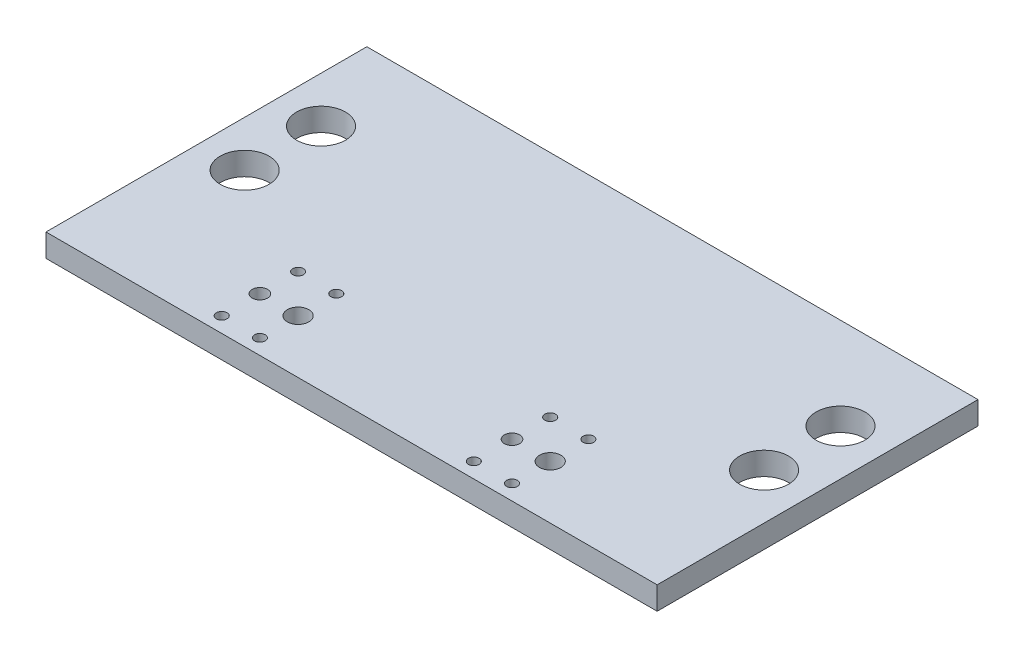
ISO-10303-21;
HEADER;
FILE_DESCRIPTION(('STEP AP214'),'2;1');
FILE_NAME('part.step','',(''),(''),'','','');
FILE_SCHEMA(('AUTOMOTIVE_DESIGN { 1 0 10303 214 1 1 1 1 }'));
ENDSEC;
DATA;
#1=APPLICATION_CONTEXT('core data for automotive mechanical design processes');
#2=APPLICATION_PROTOCOL_DEFINITION('international standard','automotive_design',2000,#1);
#3=PRODUCT_CONTEXT('',#1,'mechanical');
#4=PRODUCT('Part','Part','',(#3));
#5=PRODUCT_RELATED_PRODUCT_CATEGORY('part','',(#4));
#6=PRODUCT_DEFINITION_FORMATION('','',#4);
#7=PRODUCT_DEFINITION_CONTEXT('part definition',#1,'design');
#8=PRODUCT_DEFINITION('design','',#6,#7);
#9=PRODUCT_DEFINITION_SHAPE('','',#8);
#10=(LENGTH_UNIT() NAMED_UNIT(*) SI_UNIT(.MILLI.,.METRE.));
#11=(NAMED_UNIT(*) PLANE_ANGLE_UNIT() SI_UNIT($,.RADIAN.));
#12=(NAMED_UNIT(*) SI_UNIT($,.STERADIAN.) SOLID_ANGLE_UNIT());
#13=UNCERTAINTY_MEASURE_WITH_UNIT(LENGTH_MEASURE(1.E-05),#10,'distance_accuracy_value','');
#14=(GEOMETRIC_REPRESENTATION_CONTEXT(3) GLOBAL_UNCERTAINTY_ASSIGNED_CONTEXT((#13)) GLOBAL_UNIT_ASSIGNED_CONTEXT((#10,
#11,#12)) REPRESENTATION_CONTEXT('',''));
#15=CARTESIAN_POINT('',(0.,0.,0.));
#16=DIRECTION('',(0.,0.,1.));
#17=DIRECTION('',(1.,0.,0.));
#18=AXIS2_PLACEMENT_3D('',#15,#16,#17);
#19=CARTESIAN_POINT('',(0.,1.5,0.));
#20=DIRECTION('',(1.,0.,0.));
#21=DIRECTION('',(0.,0.,-1.));
#22=AXIS2_PLACEMENT_3D('',#19,#20,#21);
#23=PLANE('',#22);
#24=DIRECTION('',(0.,0.,1.));
#25=VECTOR('',#24,1.);
#26=CARTESIAN_POINT('',(0.,0.,0.));
#27=LINE('',#26,#25);
#28=CARTESIAN_POINT('',(0.,0.,-21.));
#29=VERTEX_POINT('',#28);
#30=CARTESIAN_POINT('',(0.,0.,0.));
#31=VERTEX_POINT('',#30);
#32=EDGE_CURVE('E94',#29,#31,#27,.T.);
#33=ORIENTED_EDGE('',*,*,#32,.T.);
#34=DIRECTION('',(0.,-1.,0.));
#35=VECTOR('',#34,1.);
#36=CARTESIAN_POINT('',(0.,1.5,0.));
#37=LINE('',#36,#35);
#38=CARTESIAN_POINT('',(0.,1.5,0.));
#39=VERTEX_POINT('',#38);
#40=EDGE_CURVE('E11',#39,#31,#37,.T.);
#41=ORIENTED_EDGE('',*,*,#40,.F.);
#42=DIRECTION('',(0.,0.,1.));
#43=VECTOR('',#42,1.);
#44=CARTESIAN_POINT('',(0.,1.5,0.));
#45=LINE('',#44,#43);
#46=CARTESIAN_POINT('',(0.,1.5,-21.));
#47=VERTEX_POINT('',#46);
#48=EDGE_CURVE('E82',#47,#39,#45,.T.);
#49=ORIENTED_EDGE('',*,*,#48,.F.);
#50=DIRECTION('',(0.,-1.,0.));
#51=VECTOR('',#50,1.);
#52=CARTESIAN_POINT('',(0.,1.5,-21.));
#53=LINE('',#52,#51);
#54=EDGE_CURVE('E90',#47,#29,#53,.T.);
#55=ORIENTED_EDGE('',*,*,#54,.T.);
#56=EDGE_LOOP('',(#33,#41,#49,#55));
#57=FACE_BOUND('',#56,.T.);
#58=ADVANCED_FACE('F31',(#57),#23,.F.);
#59=CARTESIAN_POINT('',(0.,1.5,0.));
#60=DIRECTION('',(0.,0.,-1.));
#61=DIRECTION('',(-1.,0.,0.));
#62=AXIS2_PLACEMENT_3D('',#59,#60,#61);
#63=PLANE('',#62);
#64=DIRECTION('',(1.,0.,0.));
#65=VECTOR('',#64,1.);
#66=CARTESIAN_POINT('',(0.,0.,0.));
#67=LINE('',#66,#65);
#68=CARTESIAN_POINT('',(40.,0.,0.));
#69=VERTEX_POINT('',#68);
#70=EDGE_CURVE('E86',#31,#69,#67,.T.);
#71=ORIENTED_EDGE('',*,*,#70,.T.);
#72=DIRECTION('',(0.,-1.,0.));
#73=VECTOR('',#72,1.);
#74=CARTESIAN_POINT('',(40.,1.5,0.));
#75=LINE('',#74,#73);
#76=CARTESIAN_POINT('',(40.,1.5,0.));
#77=VERTEX_POINT('',#76);
#78=EDGE_CURVE('E39',#77,#69,#75,.T.);
#79=ORIENTED_EDGE('',*,*,#78,.F.);
#80=DIRECTION('',(1.,0.,0.));
#81=VECTOR('',#80,1.);
#82=CARTESIAN_POINT('',(0.,1.5,0.));
#83=LINE('',#82,#81);
#84=EDGE_CURVE('E77',#39,#77,#83,.T.);
#85=ORIENTED_EDGE('',*,*,#84,.F.);
#86=ORIENTED_EDGE('',*,*,#40,.T.);
#87=EDGE_LOOP('',(#71,#79,#85,#86));
#88=FACE_BOUND('',#87,.T.);
#89=ADVANCED_FACE('F85',(#88),#63,.F.);
#90=CARTESIAN_POINT('',(40.,1.5,0.));
#91=DIRECTION('',(-1.,0.,0.));
#92=DIRECTION('',(0.,0.,1.));
#93=AXIS2_PLACEMENT_3D('',#90,#91,#92);
#94=PLANE('',#93);
#95=DIRECTION('',(0.,0.,-1.));
#96=VECTOR('',#95,1.);
#97=CARTESIAN_POINT('',(40.,0.,0.));
#98=LINE('',#97,#96);
#99=CARTESIAN_POINT('',(40.,0.,-21.));
#100=VERTEX_POINT('',#99);
#101=EDGE_CURVE('E64',#69,#100,#98,.T.);
#102=ORIENTED_EDGE('',*,*,#101,.T.);
#103=DIRECTION('',(0.,-1.,0.));
#104=VECTOR('',#103,1.);
#105=CARTESIAN_POINT('',(40.,1.5,-21.));
#106=LINE('',#105,#104);
#107=CARTESIAN_POINT('',(40.,1.5,-21.));
#108=VERTEX_POINT('',#107);
#109=EDGE_CURVE('E87',#108,#100,#106,.T.);
#110=ORIENTED_EDGE('',*,*,#109,.F.);
#111=DIRECTION('',(0.,0.,-1.));
#112=VECTOR('',#111,1.);
#113=CARTESIAN_POINT('',(40.,1.5,0.));
#114=LINE('',#113,#112);
#115=EDGE_CURVE('E80',#77,#108,#114,.T.);
#116=ORIENTED_EDGE('',*,*,#115,.F.);
#117=ORIENTED_EDGE('',*,*,#78,.T.);
#118=EDGE_LOOP('',(#102,#110,#116,#117));
#119=FACE_BOUND('',#118,.T.);
#120=ADVANCED_FACE('F88',(#119),#94,.F.);
#121=CARTESIAN_POINT('',(0.,1.5,-21.));
#122=DIRECTION('',(0.,0.,1.));
#123=DIRECTION('',(1.,0.,0.));
#124=AXIS2_PLACEMENT_3D('',#121,#122,#123);
#125=PLANE('',#124);
#126=DIRECTION('',(-1.,0.,0.));
#127=VECTOR('',#126,1.);
#128=CARTESIAN_POINT('',(0.,0.,-21.));
#129=LINE('',#128,#127);
#130=EDGE_CURVE('E70',#100,#29,#129,.T.);
#131=ORIENTED_EDGE('',*,*,#130,.T.);
#132=ORIENTED_EDGE('',*,*,#54,.F.);
#133=DIRECTION('',(-1.,0.,0.));
#134=VECTOR('',#133,1.);
#135=CARTESIAN_POINT('',(0.,1.5,-21.));
#136=LINE('',#135,#134);
#137=EDGE_CURVE('E47',#108,#47,#136,.T.);
#138=ORIENTED_EDGE('',*,*,#137,.F.);
#139=ORIENTED_EDGE('',*,*,#109,.T.);
#140=EDGE_LOOP('',(#131,#132,#138,#139));
#141=FACE_BOUND('',#140,.T.);
#142=ADVANCED_FACE('F102',(#141),#125,.F.);
#143=CARTESIAN_POINT('',(0.,1.5,-21.));
#144=DIRECTION('',(0.,-1.,0.));
#145=DIRECTION('',(0.,0.,-1.));
#146=AXIS2_PLACEMENT_3D('',#143,#144,#145);
#147=PLANE('',#146);
#148=CARTESIAN_POINT('',(37.,1.5,-15.));
#149=DIRECTION('',(0.,1.,0.));
#150=DIRECTION('',(0.,0.,1.));
#151=AXIS2_PLACEMENT_3D('',#148,#149,#150);
#152=CIRCLE('',#151,1.6);
#153=CARTESIAN_POINT('',(37.,1.5,-13.4));
#154=VERTEX_POINT('',#153);
#155=EDGE_CURVE('E198',#154,#154,#152,.T.);
#156=ORIENTED_EDGE('',*,*,#155,.F.);
#157=EDGE_LOOP('',(#156));
#158=FACE_BOUND('',#157,.T.);
#159=CARTESIAN_POINT('',(3.,1.5,-15.));
#160=DIRECTION('',(0.,1.,0.));
#161=DIRECTION('',(0.,0.,1.));
#162=AXIS2_PLACEMENT_3D('',#159,#160,#161);
#163=CIRCLE('',#162,1.6);
#164=CARTESIAN_POINT('',(3.,1.5,-13.4));
#165=VERTEX_POINT('',#164);
#166=EDGE_CURVE('E192',#165,#165,#163,.T.);
#167=ORIENTED_EDGE('',*,*,#166,.F.);
#168=EDGE_LOOP('',(#167));
#169=FACE_BOUND('',#168,.T.);
#170=CARTESIAN_POINT('',(37.,1.5,-10.));
#171=DIRECTION('',(0.,1.,0.));
#172=DIRECTION('',(0.,0.,1.));
#173=AXIS2_PLACEMENT_3D('',#170,#171,#172);
#174=CIRCLE('',#173,1.60000000000001);
#175=CARTESIAN_POINT('',(37.,1.5,-8.39999999999999));
#176=VERTEX_POINT('',#175);
#177=EDGE_CURVE('E186',#176,#176,#174,.T.);
#178=ORIENTED_EDGE('',*,*,#177,.F.);
#179=EDGE_LOOP('',(#178));
#180=FACE_BOUND('',#179,.T.);
#181=CARTESIAN_POINT('',(3.,1.5,-10.));
#182=DIRECTION('',(0.,1.,0.));
#183=DIRECTION('',(0.,0.,1.));
#184=AXIS2_PLACEMENT_3D('',#181,#182,#183);
#185=CIRCLE('',#184,1.6);
#186=CARTESIAN_POINT('',(3.,1.5,-8.4));
#187=VERTEX_POINT('',#186);
#188=EDGE_CURVE('E180',#187,#187,#185,.T.);
#189=ORIENTED_EDGE('',*,*,#188,.F.);
#190=EDGE_LOOP('',(#189));
#191=FACE_BOUND('',#190,.T.);
#192=CARTESIAN_POINT('',(13.,1.5,-0.999999999999997));
#193=DIRECTION('',(0.,1.,0.));
#194=DIRECTION('',(0.,0.,1.));
#195=AXIS2_PLACEMENT_3D('',#192,#193,#194);
#196=CIRCLE('',#195,0.350000000000001);
#197=CARTESIAN_POINT('',(13.,1.5,-0.649999999999996));
#198=VERTEX_POINT('',#197);
#199=EDGE_CURVE('E174',#198,#198,#196,.T.);
#200=ORIENTED_EDGE('',*,*,#199,.F.);
#201=EDGE_LOOP('',(#200));
#202=FACE_BOUND('',#201,.T.);
#203=CARTESIAN_POINT('',(10.5,1.5,-0.999999999999997));
#204=DIRECTION('',(0.,1.,0.));
#205=DIRECTION('',(0.,0.,1.));
#206=AXIS2_PLACEMENT_3D('',#203,#204,#205);
#207=CIRCLE('',#206,0.349999999999999);
#208=CARTESIAN_POINT('',(10.5,1.5,-0.649999999999998));
#209=VERTEX_POINT('',#208);
#210=EDGE_CURVE('E168',#209,#209,#207,.T.);
#211=ORIENTED_EDGE('',*,*,#210,.F.);
#212=EDGE_LOOP('',(#211));
#213=FACE_BOUND('',#212,.T.);
#214=CARTESIAN_POINT('',(10.5,1.5,-6.));
#215=DIRECTION('',(0.,1.,0.));
#216=DIRECTION('',(0.,0.,1.));
#217=AXIS2_PLACEMENT_3D('',#214,#215,#216);
#218=CIRCLE('',#217,0.349999999999999);
#219=CARTESIAN_POINT('',(10.5,1.5,-5.65));
#220=VERTEX_POINT('',#219);
#221=EDGE_CURVE('E162',#220,#220,#218,.T.);
#222=ORIENTED_EDGE('',*,*,#221,.F.);
#223=EDGE_LOOP('',(#222));
#224=FACE_BOUND('',#223,.T.);
#225=CARTESIAN_POINT('',(13.,1.5,-6.));
#226=DIRECTION('',(0.,1.,0.));
#227=DIRECTION('',(0.,0.,1.));
#228=AXIS2_PLACEMENT_3D('',#225,#226,#227);
#229=CIRCLE('',#228,0.350000000000001);
#230=CARTESIAN_POINT('',(13.,1.5,-5.65));
#231=VERTEX_POINT('',#230);
#232=EDGE_CURVE('E156',#231,#231,#229,.T.);
#233=ORIENTED_EDGE('',*,*,#232,.F.);
#234=EDGE_LOOP('',(#233));
#235=FACE_BOUND('',#234,.T.);
#236=CARTESIAN_POINT('',(27.,1.5,-0.999999999999997));
#237=DIRECTION('',(0.,1.,0.));
#238=DIRECTION('',(0.,0.,1.));
#239=AXIS2_PLACEMENT_3D('',#236,#237,#238);
#240=CIRCLE('',#239,0.350000000000001);
#241=CARTESIAN_POINT('',(27.,1.5,-0.649999999999996));
#242=VERTEX_POINT('',#241);
#243=EDGE_CURVE('E150',#242,#242,#240,.T.);
#244=ORIENTED_EDGE('',*,*,#243,.F.);
#245=EDGE_LOOP('',(#244));
#246=FACE_BOUND('',#245,.T.);
#247=CARTESIAN_POINT('',(29.5,1.5,-0.999999999999997));
#248=DIRECTION('',(0.,1.,0.));
#249=DIRECTION('',(0.,0.,1.));
#250=AXIS2_PLACEMENT_3D('',#247,#248,#249);
#251=CIRCLE('',#250,0.350000000000001);
#252=CARTESIAN_POINT('',(29.5,1.5,-0.649999999999996));
#253=VERTEX_POINT('',#252);
#254=EDGE_CURVE('E144',#253,#253,#251,.T.);
#255=ORIENTED_EDGE('',*,*,#254,.F.);
#256=EDGE_LOOP('',(#255));
#257=FACE_BOUND('',#256,.T.);
#258=CARTESIAN_POINT('',(29.5,1.5,-6.));
#259=DIRECTION('',(0.,1.,0.));
#260=DIRECTION('',(0.,0.,1.));
#261=AXIS2_PLACEMENT_3D('',#258,#259,#260);
#262=CIRCLE('',#261,0.350000000000001);
#263=CARTESIAN_POINT('',(29.5,1.5,-5.65));
#264=VERTEX_POINT('',#263);
#265=EDGE_CURVE('E138',#264,#264,#262,.T.);
#266=ORIENTED_EDGE('',*,*,#265,.F.);
#267=EDGE_LOOP('',(#266));
#268=FACE_BOUND('',#267,.T.);
#269=CARTESIAN_POINT('',(27.,1.5,-6.));
#270=DIRECTION('',(0.,1.,0.));
#271=DIRECTION('',(0.,0.,1.));
#272=AXIS2_PLACEMENT_3D('',#269,#270,#271);
#273=CIRCLE('',#272,0.350000000000001);
#274=CARTESIAN_POINT('',(27.,1.5,-5.65));
#275=VERTEX_POINT('',#274);
#276=EDGE_CURVE('E132',#275,#275,#273,.T.);
#277=ORIENTED_EDGE('',*,*,#276,.F.);
#278=EDGE_LOOP('',(#277));
#279=FACE_BOUND('',#278,.T.);
#280=CARTESIAN_POINT('',(10.5,1.5,-3.5));
#281=DIRECTION('',(0.,1.,0.));
#282=DIRECTION('',(0.,0.,1.));
#283=AXIS2_PLACEMENT_3D('',#280,#281,#282);
#284=CIRCLE('',#283,0.500000000000003);
#285=CARTESIAN_POINT('',(10.5,1.5,-2.99999999999999));
#286=VERTEX_POINT('',#285);
#287=EDGE_CURVE('E126',#286,#286,#284,.T.);
#288=ORIENTED_EDGE('',*,*,#287,.F.);
#289=EDGE_LOOP('',(#288));
#290=FACE_BOUND('',#289,.T.);
#291=CARTESIAN_POINT('',(13.,1.5,-3.5));
#292=DIRECTION('',(0.,1.,0.));
#293=DIRECTION('',(0.,0.,1.));
#294=AXIS2_PLACEMENT_3D('',#291,#292,#293);
#295=CIRCLE('',#294,0.699999999999998);
#296=CARTESIAN_POINT('',(13.,1.5,-2.8));
#297=VERTEX_POINT('',#296);
#298=EDGE_CURVE('E120',#297,#297,#295,.T.);
#299=ORIENTED_EDGE('',*,*,#298,.F.);
#300=EDGE_LOOP('',(#299));
#301=FACE_BOUND('',#300,.T.);
#302=CARTESIAN_POINT('',(27.,1.5,-3.5));
#303=DIRECTION('',(0.,1.,0.));
#304=DIRECTION('',(0.,0.,1.));
#305=AXIS2_PLACEMENT_3D('',#302,#303,#304);
#306=CIRCLE('',#305,0.499999999999995);
#307=CARTESIAN_POINT('',(27.,1.5,-3.));
#308=VERTEX_POINT('',#307);
#309=EDGE_CURVE('E114',#308,#308,#306,.T.);
#310=ORIENTED_EDGE('',*,*,#309,.F.);
#311=EDGE_LOOP('',(#310));
#312=FACE_BOUND('',#311,.T.);
#313=CARTESIAN_POINT('',(29.5,1.5,-3.5));
#314=DIRECTION('',(0.,1.,0.));
#315=DIRECTION('',(0.,0.,1.));
#316=AXIS2_PLACEMENT_3D('',#313,#314,#315);
#317=CIRCLE('',#316,0.699999999999998);
#318=CARTESIAN_POINT('',(29.5,1.5,-2.8));
#319=VERTEX_POINT('',#318);
#320=EDGE_CURVE('E108',#319,#319,#317,.T.);
#321=ORIENTED_EDGE('',*,*,#320,.F.);
#322=EDGE_LOOP('',(#321));
#323=FACE_BOUND('',#322,.T.);
#324=ORIENTED_EDGE('',*,*,#48,.T.);
#325=ORIENTED_EDGE('',*,*,#84,.T.);
#326=ORIENTED_EDGE('',*,*,#115,.T.);
#327=ORIENTED_EDGE('',*,*,#137,.T.);
#328=EDGE_LOOP('',(#324,#325,#326,#327));
#329=FACE_BOUND('',#328,.T.);
#330=ADVANCED_FACE('F78',(#158,#169,#180,#191,#202,#213,#224,#235,#246,#257,#268,#279,#290,#301,
#312,#323,#329),#147,.F.);
#331=CARTESIAN_POINT('',(0.,0.,-21.));
#332=DIRECTION('',(0.,-1.,0.));
#333=DIRECTION('',(0.,0.,-1.));
#334=AXIS2_PLACEMENT_3D('',#331,#332,#333);
#335=PLANE('',#334);
#336=CARTESIAN_POINT('',(37.,0.,-15.));
#337=DIRECTION('',(0.,1.,0.));
#338=DIRECTION('',(0.,0.,1.));
#339=AXIS2_PLACEMENT_3D('',#336,#337,#338);
#340=CIRCLE('',#339,1.6);
#341=CARTESIAN_POINT('',(37.,0.,-13.4));
#342=VERTEX_POINT('',#341);
#343=EDGE_CURVE('E195',#342,#342,#340,.T.);
#344=ORIENTED_EDGE('',*,*,#343,.T.);
#345=EDGE_LOOP('',(#344));
#346=FACE_BOUND('',#345,.T.);
#347=CARTESIAN_POINT('',(3.,0.,-15.));
#348=DIRECTION('',(0.,1.,0.));
#349=DIRECTION('',(0.,0.,1.));
#350=AXIS2_PLACEMENT_3D('',#347,#348,#349);
#351=CIRCLE('',#350,1.6);
#352=CARTESIAN_POINT('',(3.,0.,-13.4));
#353=VERTEX_POINT('',#352);
#354=EDGE_CURVE('E189',#353,#353,#351,.T.);
#355=ORIENTED_EDGE('',*,*,#354,.T.);
#356=EDGE_LOOP('',(#355));
#357=FACE_BOUND('',#356,.T.);
#358=CARTESIAN_POINT('',(37.,0.,-10.));
#359=DIRECTION('',(0.,1.,0.));
#360=DIRECTION('',(0.,0.,1.));
#361=AXIS2_PLACEMENT_3D('',#358,#359,#360);
#362=CIRCLE('',#361,1.60000000000001);
#363=CARTESIAN_POINT('',(37.,0.,-8.39999999999999));
#364=VERTEX_POINT('',#363);
#365=EDGE_CURVE('E183',#364,#364,#362,.T.);
#366=ORIENTED_EDGE('',*,*,#365,.T.);
#367=EDGE_LOOP('',(#366));
#368=FACE_BOUND('',#367,.T.);
#369=CARTESIAN_POINT('',(3.,0.,-10.));
#370=DIRECTION('',(0.,1.,0.));
#371=DIRECTION('',(0.,0.,1.));
#372=AXIS2_PLACEMENT_3D('',#369,#370,#371);
#373=CIRCLE('',#372,1.6);
#374=CARTESIAN_POINT('',(3.,0.,-8.4));
#375=VERTEX_POINT('',#374);
#376=EDGE_CURVE('E177',#375,#375,#373,.T.);
#377=ORIENTED_EDGE('',*,*,#376,.T.);
#378=EDGE_LOOP('',(#377));
#379=FACE_BOUND('',#378,.T.);
#380=CARTESIAN_POINT('',(13.,0.,-0.999999999999997));
#381=DIRECTION('',(0.,1.,0.));
#382=DIRECTION('',(0.,0.,1.));
#383=AXIS2_PLACEMENT_3D('',#380,#381,#382);
#384=CIRCLE('',#383,0.350000000000001);
#385=CARTESIAN_POINT('',(13.,0.,-0.649999999999996));
#386=VERTEX_POINT('',#385);
#387=EDGE_CURVE('E171',#386,#386,#384,.T.);
#388=ORIENTED_EDGE('',*,*,#387,.T.);
#389=EDGE_LOOP('',(#388));
#390=FACE_BOUND('',#389,.T.);
#391=CARTESIAN_POINT('',(10.5,0.,-0.999999999999997));
#392=DIRECTION('',(0.,1.,0.));
#393=DIRECTION('',(0.,0.,1.));
#394=AXIS2_PLACEMENT_3D('',#391,#392,#393);
#395=CIRCLE('',#394,0.349999999999999);
#396=CARTESIAN_POINT('',(10.5,0.,-0.649999999999998));
#397=VERTEX_POINT('',#396);
#398=EDGE_CURVE('E165',#397,#397,#395,.T.);
#399=ORIENTED_EDGE('',*,*,#398,.T.);
#400=EDGE_LOOP('',(#399));
#401=FACE_BOUND('',#400,.T.);
#402=CARTESIAN_POINT('',(10.5,0.,-6.));
#403=DIRECTION('',(0.,1.,0.));
#404=DIRECTION('',(0.,0.,1.));
#405=AXIS2_PLACEMENT_3D('',#402,#403,#404);
#406=CIRCLE('',#405,0.349999999999999);
#407=CARTESIAN_POINT('',(10.5,0.,-5.65));
#408=VERTEX_POINT('',#407);
#409=EDGE_CURVE('E159',#408,#408,#406,.T.);
#410=ORIENTED_EDGE('',*,*,#409,.T.);
#411=EDGE_LOOP('',(#410));
#412=FACE_BOUND('',#411,.T.);
#413=CARTESIAN_POINT('',(13.,0.,-6.));
#414=DIRECTION('',(0.,1.,0.));
#415=DIRECTION('',(0.,0.,1.));
#416=AXIS2_PLACEMENT_3D('',#413,#414,#415);
#417=CIRCLE('',#416,0.350000000000001);
#418=CARTESIAN_POINT('',(13.,0.,-5.65));
#419=VERTEX_POINT('',#418);
#420=EDGE_CURVE('E153',#419,#419,#417,.T.);
#421=ORIENTED_EDGE('',*,*,#420,.T.);
#422=EDGE_LOOP('',(#421));
#423=FACE_BOUND('',#422,.T.);
#424=CARTESIAN_POINT('',(27.,0.,-0.999999999999997));
#425=DIRECTION('',(0.,1.,0.));
#426=DIRECTION('',(0.,0.,1.));
#427=AXIS2_PLACEMENT_3D('',#424,#425,#426);
#428=CIRCLE('',#427,0.350000000000001);
#429=CARTESIAN_POINT('',(27.,0.,-0.649999999999996));
#430=VERTEX_POINT('',#429);
#431=EDGE_CURVE('E147',#430,#430,#428,.T.);
#432=ORIENTED_EDGE('',*,*,#431,.T.);
#433=EDGE_LOOP('',(#432));
#434=FACE_BOUND('',#433,.T.);
#435=CARTESIAN_POINT('',(29.5,0.,-0.999999999999997));
#436=DIRECTION('',(0.,1.,0.));
#437=DIRECTION('',(0.,0.,1.));
#438=AXIS2_PLACEMENT_3D('',#435,#436,#437);
#439=CIRCLE('',#438,0.350000000000001);
#440=CARTESIAN_POINT('',(29.5,0.,-0.649999999999996));
#441=VERTEX_POINT('',#440);
#442=EDGE_CURVE('E141',#441,#441,#439,.T.);
#443=ORIENTED_EDGE('',*,*,#442,.T.);
#444=EDGE_LOOP('',(#443));
#445=FACE_BOUND('',#444,.T.);
#446=CARTESIAN_POINT('',(29.5,0.,-6.));
#447=DIRECTION('',(0.,1.,0.));
#448=DIRECTION('',(0.,0.,1.));
#449=AXIS2_PLACEMENT_3D('',#446,#447,#448);
#450=CIRCLE('',#449,0.350000000000001);
#451=CARTESIAN_POINT('',(29.5,0.,-5.65));
#452=VERTEX_POINT('',#451);
#453=EDGE_CURVE('E135',#452,#452,#450,.T.);
#454=ORIENTED_EDGE('',*,*,#453,.T.);
#455=EDGE_LOOP('',(#454));
#456=FACE_BOUND('',#455,.T.);
#457=CARTESIAN_POINT('',(27.,0.,-6.));
#458=DIRECTION('',(0.,1.,0.));
#459=DIRECTION('',(0.,0.,1.));
#460=AXIS2_PLACEMENT_3D('',#457,#458,#459);
#461=CIRCLE('',#460,0.350000000000001);
#462=CARTESIAN_POINT('',(27.,0.,-5.65));
#463=VERTEX_POINT('',#462);
#464=EDGE_CURVE('E129',#463,#463,#461,.T.);
#465=ORIENTED_EDGE('',*,*,#464,.T.);
#466=EDGE_LOOP('',(#465));
#467=FACE_BOUND('',#466,.T.);
#468=CARTESIAN_POINT('',(10.5,0.,-3.5));
#469=DIRECTION('',(0.,1.,0.));
#470=DIRECTION('',(0.,0.,1.));
#471=AXIS2_PLACEMENT_3D('',#468,#469,#470);
#472=CIRCLE('',#471,0.500000000000003);
#473=CARTESIAN_POINT('',(10.5,0.,-2.99999999999999));
#474=VERTEX_POINT('',#473);
#475=EDGE_CURVE('E123',#474,#474,#472,.T.);
#476=ORIENTED_EDGE('',*,*,#475,.T.);
#477=EDGE_LOOP('',(#476));
#478=FACE_BOUND('',#477,.T.);
#479=CARTESIAN_POINT('',(13.,0.,-3.5));
#480=DIRECTION('',(0.,1.,0.));
#481=DIRECTION('',(0.,0.,1.));
#482=AXIS2_PLACEMENT_3D('',#479,#480,#481);
#483=CIRCLE('',#482,0.699999999999998);
#484=CARTESIAN_POINT('',(13.,0.,-2.8));
#485=VERTEX_POINT('',#484);
#486=EDGE_CURVE('E117',#485,#485,#483,.T.);
#487=ORIENTED_EDGE('',*,*,#486,.T.);
#488=EDGE_LOOP('',(#487));
#489=FACE_BOUND('',#488,.T.);
#490=CARTESIAN_POINT('',(27.,0.,-3.5));
#491=DIRECTION('',(0.,1.,0.));
#492=DIRECTION('',(0.,0.,1.));
#493=AXIS2_PLACEMENT_3D('',#490,#491,#492);
#494=CIRCLE('',#493,0.499999999999995);
#495=CARTESIAN_POINT('',(27.,0.,-3.));
#496=VERTEX_POINT('',#495);
#497=EDGE_CURVE('E111',#496,#496,#494,.T.);
#498=ORIENTED_EDGE('',*,*,#497,.T.);
#499=EDGE_LOOP('',(#498));
#500=FACE_BOUND('',#499,.T.);
#501=CARTESIAN_POINT('',(29.5,0.,-3.5));
#502=DIRECTION('',(0.,1.,0.));
#503=DIRECTION('',(0.,0.,1.));
#504=AXIS2_PLACEMENT_3D('',#501,#502,#503);
#505=CIRCLE('',#504,0.699999999999998);
#506=CARTESIAN_POINT('',(29.5,0.,-2.8));
#507=VERTEX_POINT('',#506);
#508=EDGE_CURVE('E97',#507,#507,#505,.T.);
#509=ORIENTED_EDGE('',*,*,#508,.T.);
#510=EDGE_LOOP('',(#509));
#511=FACE_BOUND('',#510,.T.);
#512=ORIENTED_EDGE('',*,*,#32,.F.);
#513=ORIENTED_EDGE('',*,*,#130,.F.);
#514=ORIENTED_EDGE('',*,*,#101,.F.);
#515=ORIENTED_EDGE('',*,*,#70,.F.);
#516=EDGE_LOOP('',(#512,#513,#514,#515));
#517=FACE_BOUND('',#516,.T.);
#518=ADVANCED_FACE('F105',(#346,#357,#368,#379,#390,#401,#412,#423,#434,#445,#456,#467,#478,
#489,#500,#511,#517),#335,.T.);
#519=CARTESIAN_POINT('',(29.5,0.,-3.5));
#520=DIRECTION('',(0.,1.,0.));
#521=DIRECTION('',(0.,0.,1.));
#522=AXIS2_PLACEMENT_3D('',#519,#520,#521);
#523=CYLINDRICAL_SURFACE('',#522,0.699999999999998);
#524=ORIENTED_EDGE('',*,*,#508,.F.);
#525=EDGE_LOOP('',(#524));
#526=FACE_BOUND('',#525,.T.);
#527=ORIENTED_EDGE('',*,*,#320,.T.);
#528=EDGE_LOOP('',(#527));
#529=FACE_BOUND('',#528,.T.);
#530=ADVANCED_FACE('F246',(#526,#529),#523,.F.);
#531=CARTESIAN_POINT('',(27.,0.,-3.5));
#532=DIRECTION('',(0.,1.,0.));
#533=DIRECTION('',(0.,0.,1.));
#534=AXIS2_PLACEMENT_3D('',#531,#532,#533);
#535=CYLINDRICAL_SURFACE('',#534,0.499999999999995);
#536=ORIENTED_EDGE('',*,*,#497,.F.);
#537=EDGE_LOOP('',(#536));
#538=FACE_BOUND('',#537,.T.);
#539=ORIENTED_EDGE('',*,*,#309,.T.);
#540=EDGE_LOOP('',(#539));
#541=FACE_BOUND('',#540,.T.);
#542=ADVANCED_FACE('F248',(#538,#541),#535,.F.);
#543=CARTESIAN_POINT('',(13.,0.,-3.5));
#544=DIRECTION('',(0.,1.,0.));
#545=DIRECTION('',(0.,0.,1.));
#546=AXIS2_PLACEMENT_3D('',#543,#544,#545);
#547=CYLINDRICAL_SURFACE('',#546,0.699999999999998);
#548=ORIENTED_EDGE('',*,*,#486,.F.);
#549=EDGE_LOOP('',(#548));
#550=FACE_BOUND('',#549,.T.);
#551=ORIENTED_EDGE('',*,*,#298,.T.);
#552=EDGE_LOOP('',(#551));
#553=FACE_BOUND('',#552,.T.);
#554=ADVANCED_FACE('F255',(#550,#553),#547,.F.);
#555=CARTESIAN_POINT('',(10.5,0.,-3.5));
#556=DIRECTION('',(0.,1.,0.));
#557=DIRECTION('',(0.,0.,1.));
#558=AXIS2_PLACEMENT_3D('',#555,#556,#557);
#559=CYLINDRICAL_SURFACE('',#558,0.500000000000003);
#560=ORIENTED_EDGE('',*,*,#475,.F.);
#561=EDGE_LOOP('',(#560));
#562=FACE_BOUND('',#561,.T.);
#563=ORIENTED_EDGE('',*,*,#287,.T.);
#564=EDGE_LOOP('',(#563));
#565=FACE_BOUND('',#564,.T.);
#566=ADVANCED_FACE('F301',(#562,#565),#559,.F.);
#567=CARTESIAN_POINT('',(27.,0.,-6.));
#568=DIRECTION('',(0.,1.,0.));
#569=DIRECTION('',(0.,0.,1.));
#570=AXIS2_PLACEMENT_3D('',#567,#568,#569);
#571=CYLINDRICAL_SURFACE('',#570,0.350000000000001);
#572=ORIENTED_EDGE('',*,*,#464,.F.);
#573=EDGE_LOOP('',(#572));
#574=FACE_BOUND('',#573,.T.);
#575=ORIENTED_EDGE('',*,*,#276,.T.);
#576=EDGE_LOOP('',(#575));
#577=FACE_BOUND('',#576,.T.);
#578=ADVANCED_FACE('F311',(#574,#577),#571,.F.);
#579=CARTESIAN_POINT('',(29.5,0.,-6.));
#580=DIRECTION('',(0.,1.,0.));
#581=DIRECTION('',(0.,0.,1.));
#582=AXIS2_PLACEMENT_3D('',#579,#580,#581);
#583=CYLINDRICAL_SURFACE('',#582,0.350000000000001);
#584=ORIENTED_EDGE('',*,*,#453,.F.);
#585=EDGE_LOOP('',(#584));
#586=FACE_BOUND('',#585,.T.);
#587=ORIENTED_EDGE('',*,*,#265,.T.);
#588=EDGE_LOOP('',(#587));
#589=FACE_BOUND('',#588,.T.);
#590=ADVANCED_FACE('F321',(#586,#589),#583,.F.);
#591=CARTESIAN_POINT('',(29.5,0.,-0.999999999999997));
#592=DIRECTION('',(0.,1.,0.));
#593=DIRECTION('',(0.,0.,1.));
#594=AXIS2_PLACEMENT_3D('',#591,#592,#593);
#595=CYLINDRICAL_SURFACE('',#594,0.350000000000001);
#596=ORIENTED_EDGE('',*,*,#442,.F.);
#597=EDGE_LOOP('',(#596));
#598=FACE_BOUND('',#597,.T.);
#599=ORIENTED_EDGE('',*,*,#254,.T.);
#600=EDGE_LOOP('',(#599));
#601=FACE_BOUND('',#600,.T.);
#602=ADVANCED_FACE('F331',(#598,#601),#595,.F.);
#603=CARTESIAN_POINT('',(27.,0.,-0.999999999999997));
#604=DIRECTION('',(0.,1.,0.));
#605=DIRECTION('',(0.,0.,1.));
#606=AXIS2_PLACEMENT_3D('',#603,#604,#605);
#607=CYLINDRICAL_SURFACE('',#606,0.350000000000001);
#608=ORIENTED_EDGE('',*,*,#431,.F.);
#609=EDGE_LOOP('',(#608));
#610=FACE_BOUND('',#609,.T.);
#611=ORIENTED_EDGE('',*,*,#243,.T.);
#612=EDGE_LOOP('',(#611));
#613=FACE_BOUND('',#612,.T.);
#614=ADVANCED_FACE('F341',(#610,#613),#607,.F.);
#615=CARTESIAN_POINT('',(13.,0.,-6.));
#616=DIRECTION('',(0.,1.,0.));
#617=DIRECTION('',(0.,0.,1.));
#618=AXIS2_PLACEMENT_3D('',#615,#616,#617);
#619=CYLINDRICAL_SURFACE('',#618,0.350000000000001);
#620=ORIENTED_EDGE('',*,*,#420,.F.);
#621=EDGE_LOOP('',(#620));
#622=FACE_BOUND('',#621,.T.);
#623=ORIENTED_EDGE('',*,*,#232,.T.);
#624=EDGE_LOOP('',(#623));
#625=FACE_BOUND('',#624,.T.);
#626=ADVANCED_FACE('F351',(#622,#625),#619,.F.);
#627=CARTESIAN_POINT('',(10.5,0.,-6.));
#628=DIRECTION('',(0.,1.,0.));
#629=DIRECTION('',(0.,0.,1.));
#630=AXIS2_PLACEMENT_3D('',#627,#628,#629);
#631=CYLINDRICAL_SURFACE('',#630,0.349999999999999);
#632=ORIENTED_EDGE('',*,*,#409,.F.);
#633=EDGE_LOOP('',(#632));
#634=FACE_BOUND('',#633,.T.);
#635=ORIENTED_EDGE('',*,*,#221,.T.);
#636=EDGE_LOOP('',(#635));
#637=FACE_BOUND('',#636,.T.);
#638=ADVANCED_FACE('F361',(#634,#637),#631,.F.);
#639=CARTESIAN_POINT('',(10.5,0.,-0.999999999999997));
#640=DIRECTION('',(0.,1.,0.));
#641=DIRECTION('',(0.,0.,1.));
#642=AXIS2_PLACEMENT_3D('',#639,#640,#641);
#643=CYLINDRICAL_SURFACE('',#642,0.349999999999999);
#644=ORIENTED_EDGE('',*,*,#398,.F.);
#645=EDGE_LOOP('',(#644));
#646=FACE_BOUND('',#645,.T.);
#647=ORIENTED_EDGE('',*,*,#210,.T.);
#648=EDGE_LOOP('',(#647));
#649=FACE_BOUND('',#648,.T.);
#650=ADVANCED_FACE('F371',(#646,#649),#643,.F.);
#651=CARTESIAN_POINT('',(13.,0.,-0.999999999999997));
#652=DIRECTION('',(0.,1.,0.));
#653=DIRECTION('',(0.,0.,1.));
#654=AXIS2_PLACEMENT_3D('',#651,#652,#653);
#655=CYLINDRICAL_SURFACE('',#654,0.350000000000001);
#656=ORIENTED_EDGE('',*,*,#387,.F.);
#657=EDGE_LOOP('',(#656));
#658=FACE_BOUND('',#657,.T.);
#659=ORIENTED_EDGE('',*,*,#199,.T.);
#660=EDGE_LOOP('',(#659));
#661=FACE_BOUND('',#660,.T.);
#662=ADVANCED_FACE('F381',(#658,#661),#655,.F.);
#663=CARTESIAN_POINT('',(3.,0.,-10.));
#664=DIRECTION('',(0.,1.,0.));
#665=DIRECTION('',(0.,0.,1.));
#666=AXIS2_PLACEMENT_3D('',#663,#664,#665);
#667=CYLINDRICAL_SURFACE('',#666,1.6);
#668=ORIENTED_EDGE('',*,*,#376,.F.);
#669=EDGE_LOOP('',(#668));
#670=FACE_BOUND('',#669,.T.);
#671=ORIENTED_EDGE('',*,*,#188,.T.);
#672=EDGE_LOOP('',(#671));
#673=FACE_BOUND('',#672,.T.);
#674=ADVANCED_FACE('F391',(#670,#673),#667,.F.);
#675=CARTESIAN_POINT('',(37.,0.,-10.));
#676=DIRECTION('',(0.,1.,0.));
#677=DIRECTION('',(0.,0.,1.));
#678=AXIS2_PLACEMENT_3D('',#675,#676,#677);
#679=CYLINDRICAL_SURFACE('',#678,1.60000000000001);
#680=ORIENTED_EDGE('',*,*,#365,.F.);
#681=EDGE_LOOP('',(#680));
#682=FACE_BOUND('',#681,.T.);
#683=ORIENTED_EDGE('',*,*,#177,.T.);
#684=EDGE_LOOP('',(#683));
#685=FACE_BOUND('',#684,.T.);
#686=ADVANCED_FACE('F401',(#682,#685),#679,.F.);
#687=CARTESIAN_POINT('',(3.,0.,-15.));
#688=DIRECTION('',(0.,1.,0.));
#689=DIRECTION('',(0.,0.,1.));
#690=AXIS2_PLACEMENT_3D('',#687,#688,#689);
#691=CYLINDRICAL_SURFACE('',#690,1.6);
#692=ORIENTED_EDGE('',*,*,#354,.F.);
#693=EDGE_LOOP('',(#692));
#694=FACE_BOUND('',#693,.T.);
#695=ORIENTED_EDGE('',*,*,#166,.T.);
#696=EDGE_LOOP('',(#695));
#697=FACE_BOUND('',#696,.T.);
#698=ADVANCED_FACE('F209',(#694,#697),#691,.F.);
#699=CARTESIAN_POINT('',(37.,0.,-15.));
#700=DIRECTION('',(0.,1.,0.));
#701=DIRECTION('',(0.,0.,1.));
#702=AXIS2_PLACEMENT_3D('',#699,#700,#701);
#703=CYLINDRICAL_SURFACE('',#702,1.6);
#704=ORIENTED_EDGE('',*,*,#343,.F.);
#705=EDGE_LOOP('',(#704));
#706=FACE_BOUND('',#705,.T.);
#707=ORIENTED_EDGE('',*,*,#155,.T.);
#708=EDGE_LOOP('',(#707));
#709=FACE_BOUND('',#708,.T.);
#710=ADVANCED_FACE('F206',(#706,#709),#703,.F.);
#711=CLOSED_SHELL('',(#58,#89,#120,#142,#330,#518,#530,#542,#554,#566,#578,#590,#602,#614,#626,
#638,#650,#662,#674,#686,#698,#710));
#712=MANIFOLD_SOLID_BREP('B2',#711);
#713=ADVANCED_BREP_SHAPE_REPRESENTATION('',(#18,#712),#14);
#714=SHAPE_DEFINITION_REPRESENTATION(#9,#713);
ENDSEC;
END-ISO-10303-21;
